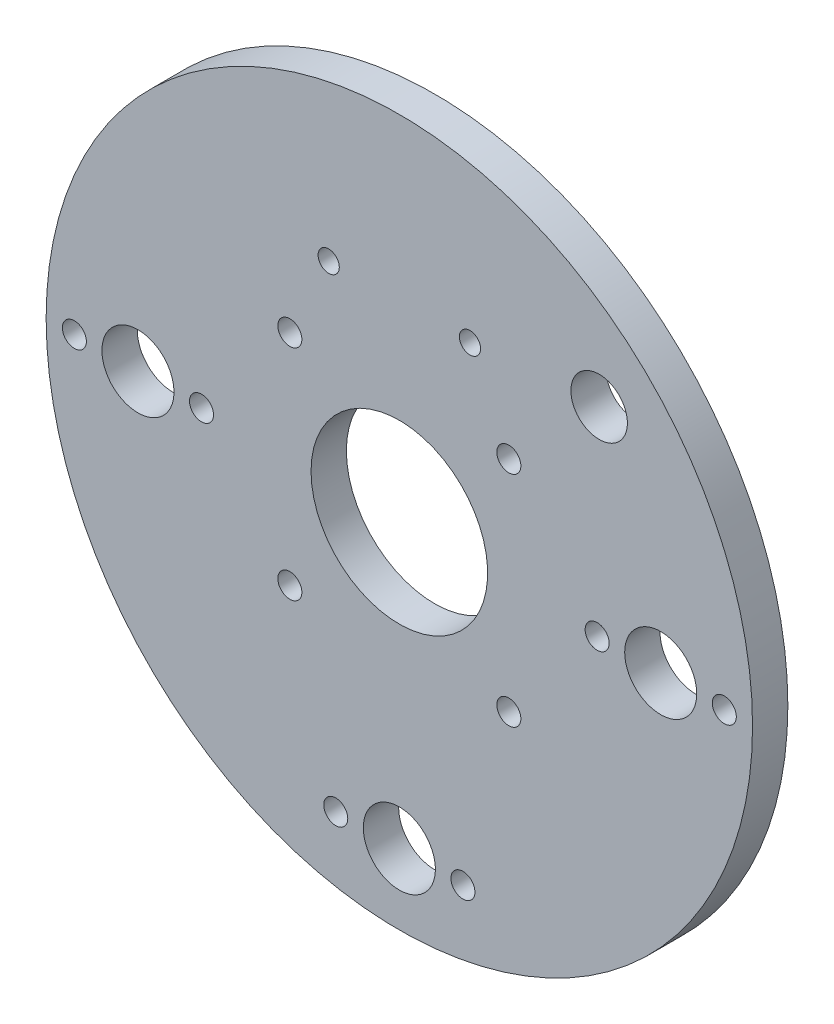
ISO-10303-21;
HEADER;
FILE_DESCRIPTION(('STEP AP214'),'2;1');
FILE_NAME('part.step','',(''),(''),'','','');
FILE_SCHEMA(('AUTOMOTIVE_DESIGN { 1 0 10303 214 1 1 1 1 }'));
ENDSEC;
DATA;
#1=APPLICATION_CONTEXT('core data for automotive mechanical design processes');
#2=APPLICATION_PROTOCOL_DEFINITION('international standard','automotive_design',2000,#1);
#3=PRODUCT_CONTEXT('',#1,'mechanical');
#4=PRODUCT('Part','Part','',(#3));
#5=PRODUCT_RELATED_PRODUCT_CATEGORY('part','',(#4));
#6=PRODUCT_DEFINITION_FORMATION('','',#4);
#7=PRODUCT_DEFINITION_CONTEXT('part definition',#1,'design');
#8=PRODUCT_DEFINITION('design','',#6,#7);
#9=PRODUCT_DEFINITION_SHAPE('','',#8);
#10=(LENGTH_UNIT() NAMED_UNIT(*) SI_UNIT(.MILLI.,.METRE.));
#11=(NAMED_UNIT(*) PLANE_ANGLE_UNIT() SI_UNIT($,.RADIAN.));
#12=(NAMED_UNIT(*) SI_UNIT($,.STERADIAN.) SOLID_ANGLE_UNIT());
#13=UNCERTAINTY_MEASURE_WITH_UNIT(LENGTH_MEASURE(1.E-05),#10,'distance_accuracy_value','');
#14=(GEOMETRIC_REPRESENTATION_CONTEXT(3) GLOBAL_UNCERTAINTY_ASSIGNED_CONTEXT((#13)) GLOBAL_UNIT_ASSIGNED_CONTEXT((#10,
#11,#12)) REPRESENTATION_CONTEXT('',''));
#15=CARTESIAN_POINT('',(0.,0.,0.));
#16=DIRECTION('',(0.,0.,1.));
#17=DIRECTION('',(1.,0.,0.));
#18=AXIS2_PLACEMENT_3D('',#15,#16,#17);
#19=CARTESIAN_POINT('',(0.,0.,5.));
#20=DIRECTION('',(0.,0.,-1.));
#21=DIRECTION('',(-1.,0.,0.));
#22=AXIS2_PLACEMENT_3D('',#19,#20,#21);
#23=CYLINDRICAL_SURFACE('',#22,50.);
#24=CARTESIAN_POINT('',(0.,0.,5.));
#25=DIRECTION('',(0.,0.,1.));
#26=DIRECTION('',(1.,0.,0.));
#27=AXIS2_PLACEMENT_3D('',#24,#25,#26);
#28=CIRCLE('',#27,50.);
#29=CARTESIAN_POINT('',(50.,0.,5.));
#30=VERTEX_POINT('',#29);
#31=EDGE_CURVE('E10',#30,#30,#28,.T.);
#32=ORIENTED_EDGE('',*,*,#31,.F.);
#33=EDGE_LOOP('',(#32));
#34=FACE_BOUND('',#33,.T.);
#35=CARTESIAN_POINT('',(0.,0.,0.));
#36=DIRECTION('',(0.,0.,1.));
#37=DIRECTION('',(1.,0.,0.));
#38=AXIS2_PLACEMENT_3D('',#35,#36,#37);
#39=CIRCLE('',#38,50.);
#40=CARTESIAN_POINT('',(50.,0.,0.));
#41=VERTEX_POINT('',#40);
#42=EDGE_CURVE('E39',#41,#41,#39,.T.);
#43=ORIENTED_EDGE('',*,*,#42,.T.);
#44=EDGE_LOOP('',(#43));
#45=FACE_BOUND('',#44,.T.);
#46=ADVANCED_FACE('F32',(#34,#45),#23,.T.);
#47=CARTESIAN_POINT('',(0.,0.,5.));
#48=DIRECTION('',(0.,0.,1.));
#49=DIRECTION('',(1.,0.,0.));
#50=AXIS2_PLACEMENT_3D('',#47,#48,#49);
#51=PLANE('',#50);
#52=CARTESIAN_POINT('',(28.2842712474618,28.284271247462,5.));
#53=DIRECTION('',(0.,0.,1.));
#54=DIRECTION('',(1.,0.,0.));
#55=AXIS2_PLACEMENT_3D('',#52,#53,#54);
#56=CIRCLE('',#55,4.);
#57=CARTESIAN_POINT('',(32.2842712474618,28.284271247462,5.));
#58=VERTEX_POINT('',#57);
#59=EDGE_CURVE('E176',#58,#58,#56,.T.);
#60=ORIENTED_EDGE('',*,*,#59,.F.);
#61=EDGE_LOOP('',(#60));
#62=FACE_BOUND('',#61,.T.);
#63=CARTESIAN_POINT('',(-10.,27.,5.));
#64=DIRECTION('',(0.,0.,1.));
#65=DIRECTION('',(1.,0.,0.));
#66=AXIS2_PLACEMENT_3D('',#63,#64,#65);
#67=CIRCLE('',#66,1.5);
#68=CARTESIAN_POINT('',(-8.5,27.,5.));
#69=VERTEX_POINT('',#68);
#70=EDGE_CURVE('E52',#69,#69,#67,.T.);
#71=ORIENTED_EDGE('',*,*,#70,.F.);
#72=EDGE_LOOP('',(#71));
#73=FACE_BOUND('',#72,.T.);
#74=CARTESIAN_POINT('',(10.,27.,5.));
#75=DIRECTION('',(0.,0.,1.));
#76=DIRECTION('',(1.,0.,0.));
#77=AXIS2_PLACEMENT_3D('',#74,#75,#76);
#78=CIRCLE('',#77,1.5);
#79=CARTESIAN_POINT('',(11.5,27.,5.));
#80=VERTEX_POINT('',#79);
#81=EDGE_CURVE('E66',#80,#80,#78,.T.);
#82=ORIENTED_EDGE('',*,*,#81,.F.);
#83=EDGE_LOOP('',(#82));
#84=FACE_BOUND('',#83,.T.);
#85=CARTESIAN_POINT('',(15.5,15.5,5.));
#86=DIRECTION('',(0.,0.,1.));
#87=DIRECTION('',(1.,0.,0.));
#88=AXIS2_PLACEMENT_3D('',#85,#86,#87);
#89=CIRCLE('',#88,1.7);
#90=CARTESIAN_POINT('',(17.2,15.5,5.));
#91=VERTEX_POINT('',#90);
#92=EDGE_CURVE('E54',#91,#91,#89,.T.);
#93=ORIENTED_EDGE('',*,*,#92,.F.);
#94=EDGE_LOOP('',(#93));
#95=FACE_BOUND('',#94,.T.);
#96=CARTESIAN_POINT('',(15.5000000000009,-15.5,5.));
#97=DIRECTION('',(0.,0.,1.));
#98=DIRECTION('',(1.,0.,0.));
#99=AXIS2_PLACEMENT_3D('',#96,#97,#98);
#100=CIRCLE('',#99,1.7);
#101=CARTESIAN_POINT('',(17.2000000000009,-15.5,5.));
#102=VERTEX_POINT('',#101);
#103=EDGE_CURVE('E63',#102,#102,#100,.T.);
#104=ORIENTED_EDGE('',*,*,#103,.F.);
#105=EDGE_LOOP('',(#104));
#106=FACE_BOUND('',#105,.T.);
#107=CARTESIAN_POINT('',(-15.4999999999991,-15.5000000000009,5.));
#108=DIRECTION('',(0.,0.,1.));
#109=DIRECTION('',(1.,0.,0.));
#110=AXIS2_PLACEMENT_3D('',#107,#108,#109);
#111=CIRCLE('',#110,1.7);
#112=CARTESIAN_POINT('',(-13.7999999999991,-15.5000000000009,5.));
#113=VERTEX_POINT('',#112);
#114=EDGE_CURVE('E74',#113,#113,#111,.T.);
#115=ORIENTED_EDGE('',*,*,#114,.F.);
#116=EDGE_LOOP('',(#115));
#117=FACE_BOUND('',#116,.T.);
#118=CARTESIAN_POINT('',(-15.5,15.4999999999991,5.));
#119=DIRECTION('',(0.,0.,1.));
#120=DIRECTION('',(1.,0.,0.));
#121=AXIS2_PLACEMENT_3D('',#118,#119,#120);
#122=CIRCLE('',#121,1.7);
#123=CARTESIAN_POINT('',(-13.8,15.4999999999991,5.));
#124=VERTEX_POINT('',#123);
#125=EDGE_CURVE('E80',#124,#124,#122,.T.);
#126=ORIENTED_EDGE('',*,*,#125,.F.);
#127=EDGE_LOOP('',(#126));
#128=FACE_BOUND('',#127,.T.);
#129=CARTESIAN_POINT('',(46.,0.,5.));
#130=DIRECTION('',(0.,0.,1.));
#131=DIRECTION('',(1.,0.,0.));
#132=AXIS2_PLACEMENT_3D('',#129,#130,#131);
#133=CIRCLE('',#132,1.7);
#134=CARTESIAN_POINT('',(47.7,0.,5.));
#135=VERTEX_POINT('',#134);
#136=EDGE_CURVE('E86',#135,#135,#133,.T.);
#137=ORIENTED_EDGE('',*,*,#136,.F.);
#138=EDGE_LOOP('',(#137));
#139=FACE_BOUND('',#138,.T.);
#140=CARTESIAN_POINT('',(28.,0.,5.));
#141=DIRECTION('',(0.,0.,1.));
#142=DIRECTION('',(1.,0.,0.));
#143=AXIS2_PLACEMENT_3D('',#140,#141,#142);
#144=CIRCLE('',#143,1.7);
#145=CARTESIAN_POINT('',(29.7,0.,5.));
#146=VERTEX_POINT('',#145);
#147=EDGE_CURVE('E92',#146,#146,#144,.T.);
#148=ORIENTED_EDGE('',*,*,#147,.F.);
#149=EDGE_LOOP('',(#148));
#150=FACE_BOUND('',#149,.T.);
#151=CARTESIAN_POINT('',(9.,-40.,5.));
#152=DIRECTION('',(0.,0.,1.));
#153=DIRECTION('',(1.,0.,0.));
#154=AXIS2_PLACEMENT_3D('',#151,#152,#153);
#155=CIRCLE('',#154,1.7);
#156=CARTESIAN_POINT('',(10.7,-40.,5.));
#157=VERTEX_POINT('',#156);
#158=EDGE_CURVE('E98',#157,#157,#155,.T.);
#159=ORIENTED_EDGE('',*,*,#158,.F.);
#160=EDGE_LOOP('',(#159));
#161=FACE_BOUND('',#160,.T.);
#162=CARTESIAN_POINT('',(-9.,-40.,5.));
#163=DIRECTION('',(0.,0.,1.));
#164=DIRECTION('',(1.,0.,0.));
#165=AXIS2_PLACEMENT_3D('',#162,#163,#164);
#166=CIRCLE('',#165,1.7);
#167=CARTESIAN_POINT('',(-7.3,-40.,5.));
#168=VERTEX_POINT('',#167);
#169=EDGE_CURVE('E104',#168,#168,#166,.T.);
#170=ORIENTED_EDGE('',*,*,#169,.F.);
#171=EDGE_LOOP('',(#170));
#172=FACE_BOUND('',#171,.T.);
#173=CARTESIAN_POINT('',(-46.,2.97129651685814E-13,5.));
#174=DIRECTION('',(0.,0.,1.));
#175=DIRECTION('',(1.,0.,0.));
#176=AXIS2_PLACEMENT_3D('',#173,#174,#175);
#177=CIRCLE('',#176,1.7);
#178=CARTESIAN_POINT('',(-44.3,2.97129651685814E-13,5.));
#179=VERTEX_POINT('',#178);
#180=EDGE_CURVE('E110',#179,#179,#177,.T.);
#181=ORIENTED_EDGE('',*,*,#180,.F.);
#182=EDGE_LOOP('',(#181));
#183=FACE_BOUND('',#182,.T.);
#184=CARTESIAN_POINT('',(-28.,-1.71810817162361E-12,5.));
#185=DIRECTION('',(0.,0.,1.));
#186=DIRECTION('',(1.,0.,0.));
#187=AXIS2_PLACEMENT_3D('',#184,#185,#186);
#188=CIRCLE('',#187,1.7);
#189=CARTESIAN_POINT('',(-26.3,-1.71810817162361E-12,5.));
#190=VERTEX_POINT('',#189);
#191=EDGE_CURVE('E116',#190,#190,#188,.T.);
#192=ORIENTED_EDGE('',*,*,#191,.F.);
#193=EDGE_LOOP('',(#192));
#194=FACE_BOUND('',#193,.T.);
#195=CARTESIAN_POINT('',(-37.,0.,5.));
#196=DIRECTION('',(0.,0.,-1.));
#197=DIRECTION('',(-1.,0.,0.));
#198=AXIS2_PLACEMENT_3D('',#195,#196,#197);
#199=CIRCLE('',#198,5.1);
#200=CARTESIAN_POINT('',(-42.1,0.,5.));
#201=VERTEX_POINT('',#200);
#202=EDGE_CURVE('E125',#201,#201,#199,.T.);
#203=ORIENTED_EDGE('',*,*,#202,.T.);
#204=EDGE_LOOP('',(#203));
#205=FACE_BOUND('',#204,.T.);
#206=CARTESIAN_POINT('',(37.,2.68166793467571E-13,5.));
#207=DIRECTION('',(0.,0.,-1.));
#208=DIRECTION('',(-1.,0.,0.));
#209=AXIS2_PLACEMENT_3D('',#206,#207,#208);
#210=CIRCLE('',#209,5.1);
#211=CARTESIAN_POINT('',(31.9,2.68166793467571E-13,5.));
#212=VERTEX_POINT('',#211);
#213=EDGE_CURVE('E131',#212,#212,#210,.T.);
#214=ORIENTED_EDGE('',*,*,#213,.T.);
#215=EDGE_LOOP('',(#214));
#216=FACE_BOUND('',#215,.T.);
#217=CARTESIAN_POINT('',(0.,-40.,5.));
#218=DIRECTION('',(0.,0.,-1.));
#219=DIRECTION('',(-1.,0.,0.));
#220=AXIS2_PLACEMENT_3D('',#217,#218,#219);
#221=CIRCLE('',#220,5.1);
#222=CARTESIAN_POINT('',(-5.1,-40.,5.));
#223=VERTEX_POINT('',#222);
#224=EDGE_CURVE('E137',#223,#223,#221,.T.);
#225=ORIENTED_EDGE('',*,*,#224,.T.);
#226=EDGE_LOOP('',(#225));
#227=FACE_BOUND('',#226,.T.);
#228=CARTESIAN_POINT('',(0.,0.,5.));
#229=DIRECTION('',(0.,0.,-1.));
#230=DIRECTION('',(-1.,0.,0.));
#231=AXIS2_PLACEMENT_3D('',#228,#229,#230);
#232=CIRCLE('',#231,12.5);
#233=CARTESIAN_POINT('',(-12.5,0.,5.));
#234=VERTEX_POINT('',#233);
#235=EDGE_CURVE('E44',#234,#234,#232,.T.);
#236=ORIENTED_EDGE('',*,*,#235,.T.);
#237=EDGE_LOOP('',(#236));
#238=FACE_BOUND('',#237,.T.);
#239=ORIENTED_EDGE('',*,*,#31,.T.);
#240=EDGE_LOOP('',(#239));
#241=FACE_BOUND('',#240,.T.);
#242=ADVANCED_FACE('F146',(#62,#73,#84,#95,#106,#117,#128,#139,#150,#161,#172,#183,#194,#205,
#216,#227,#238,#241),#51,.T.);
#243=CARTESIAN_POINT('',(0.,0.,0.));
#244=DIRECTION('',(0.,0.,1.));
#245=DIRECTION('',(1.,0.,0.));
#246=AXIS2_PLACEMENT_3D('',#243,#244,#245);
#247=PLANE('',#246);
#248=CARTESIAN_POINT('',(28.2842712474618,28.284271247462,0.));
#249=DIRECTION('',(0.,0.,1.));
#250=DIRECTION('',(1.,0.,0.));
#251=AXIS2_PLACEMENT_3D('',#248,#249,#250);
#252=CIRCLE('',#251,4.);
#253=CARTESIAN_POINT('',(32.2842712474618,28.284271247462,0.));
#254=VERTEX_POINT('',#253);
#255=EDGE_CURVE('E35',#254,#254,#252,.T.);
#256=ORIENTED_EDGE('',*,*,#255,.T.);
#257=EDGE_LOOP('',(#256));
#258=FACE_BOUND('',#257,.T.);
#259=CARTESIAN_POINT('',(-10.,27.,0.));
#260=DIRECTION('',(0.,0.,1.));
#261=DIRECTION('',(1.,0.,0.));
#262=AXIS2_PLACEMENT_3D('',#259,#260,#261);
#263=CIRCLE('',#262,1.5);
#264=CARTESIAN_POINT('',(-8.5,27.,0.));
#265=VERTEX_POINT('',#264);
#266=EDGE_CURVE('E51',#265,#265,#263,.T.);
#267=ORIENTED_EDGE('',*,*,#266,.T.);
#268=EDGE_LOOP('',(#267));
#269=FACE_BOUND('',#268,.T.);
#270=CARTESIAN_POINT('',(10.,27.,0.));
#271=DIRECTION('',(0.,0.,1.));
#272=DIRECTION('',(1.,0.,0.));
#273=AXIS2_PLACEMENT_3D('',#270,#271,#272);
#274=CIRCLE('',#273,1.5);
#275=CARTESIAN_POINT('',(11.5,27.,0.));
#276=VERTEX_POINT('',#275);
#277=EDGE_CURVE('E49',#276,#276,#274,.T.);
#278=ORIENTED_EDGE('',*,*,#277,.T.);
#279=EDGE_LOOP('',(#278));
#280=FACE_BOUND('',#279,.T.);
#281=CARTESIAN_POINT('',(15.5,15.5,0.));
#282=DIRECTION('',(0.,0.,1.));
#283=DIRECTION('',(1.,0.,0.));
#284=AXIS2_PLACEMENT_3D('',#281,#282,#283);
#285=CIRCLE('',#284,1.7);
#286=CARTESIAN_POINT('',(17.2,15.5,0.));
#287=VERTEX_POINT('',#286);
#288=EDGE_CURVE('E58',#287,#287,#285,.T.);
#289=ORIENTED_EDGE('',*,*,#288,.T.);
#290=EDGE_LOOP('',(#289));
#291=FACE_BOUND('',#290,.T.);
#292=CARTESIAN_POINT('',(15.5000000000009,-15.5,0.));
#293=DIRECTION('',(0.,0.,1.));
#294=DIRECTION('',(1.,0.,0.));
#295=AXIS2_PLACEMENT_3D('',#292,#293,#294);
#296=CIRCLE('',#295,1.7);
#297=CARTESIAN_POINT('',(17.2000000000009,-15.5,0.));
#298=VERTEX_POINT('',#297);
#299=EDGE_CURVE('E71',#298,#298,#296,.T.);
#300=ORIENTED_EDGE('',*,*,#299,.T.);
#301=EDGE_LOOP('',(#300));
#302=FACE_BOUND('',#301,.T.);
#303=CARTESIAN_POINT('',(-15.4999999999991,-15.5000000000009,0.));
#304=DIRECTION('',(0.,0.,1.));
#305=DIRECTION('',(1.,0.,0.));
#306=AXIS2_PLACEMENT_3D('',#303,#304,#305);
#307=CIRCLE('',#306,1.7);
#308=CARTESIAN_POINT('',(-13.7999999999991,-15.5000000000009,0.));
#309=VERTEX_POINT('',#308);
#310=EDGE_CURVE('E77',#309,#309,#307,.T.);
#311=ORIENTED_EDGE('',*,*,#310,.T.);
#312=EDGE_LOOP('',(#311));
#313=FACE_BOUND('',#312,.T.);
#314=CARTESIAN_POINT('',(-15.5,15.4999999999991,0.));
#315=DIRECTION('',(0.,0.,1.));
#316=DIRECTION('',(1.,0.,0.));
#317=AXIS2_PLACEMENT_3D('',#314,#315,#316);
#318=CIRCLE('',#317,1.7);
#319=CARTESIAN_POINT('',(-13.8,15.4999999999991,0.));
#320=VERTEX_POINT('',#319);
#321=EDGE_CURVE('E83',#320,#320,#318,.T.);
#322=ORIENTED_EDGE('',*,*,#321,.T.);
#323=EDGE_LOOP('',(#322));
#324=FACE_BOUND('',#323,.T.);
#325=CARTESIAN_POINT('',(46.,0.,0.));
#326=DIRECTION('',(0.,0.,1.));
#327=DIRECTION('',(1.,0.,0.));
#328=AXIS2_PLACEMENT_3D('',#325,#326,#327);
#329=CIRCLE('',#328,1.7);
#330=CARTESIAN_POINT('',(47.7,0.,0.));
#331=VERTEX_POINT('',#330);
#332=EDGE_CURVE('E89',#331,#331,#329,.T.);
#333=ORIENTED_EDGE('',*,*,#332,.T.);
#334=EDGE_LOOP('',(#333));
#335=FACE_BOUND('',#334,.T.);
#336=CARTESIAN_POINT('',(28.,0.,0.));
#337=DIRECTION('',(0.,0.,1.));
#338=DIRECTION('',(1.,0.,0.));
#339=AXIS2_PLACEMENT_3D('',#336,#337,#338);
#340=CIRCLE('',#339,1.7);
#341=CARTESIAN_POINT('',(29.7,0.,0.));
#342=VERTEX_POINT('',#341);
#343=EDGE_CURVE('E95',#342,#342,#340,.T.);
#344=ORIENTED_EDGE('',*,*,#343,.T.);
#345=EDGE_LOOP('',(#344));
#346=FACE_BOUND('',#345,.T.);
#347=CARTESIAN_POINT('',(9.,-40.,0.));
#348=DIRECTION('',(0.,0.,1.));
#349=DIRECTION('',(1.,0.,0.));
#350=AXIS2_PLACEMENT_3D('',#347,#348,#349);
#351=CIRCLE('',#350,1.7);
#352=CARTESIAN_POINT('',(10.7,-40.,0.));
#353=VERTEX_POINT('',#352);
#354=EDGE_CURVE('E101',#353,#353,#351,.T.);
#355=ORIENTED_EDGE('',*,*,#354,.T.);
#356=EDGE_LOOP('',(#355));
#357=FACE_BOUND('',#356,.T.);
#358=CARTESIAN_POINT('',(-9.,-40.,0.));
#359=DIRECTION('',(0.,0.,1.));
#360=DIRECTION('',(1.,0.,0.));
#361=AXIS2_PLACEMENT_3D('',#358,#359,#360);
#362=CIRCLE('',#361,1.7);
#363=CARTESIAN_POINT('',(-7.3,-40.,0.));
#364=VERTEX_POINT('',#363);
#365=EDGE_CURVE('E107',#364,#364,#362,.T.);
#366=ORIENTED_EDGE('',*,*,#365,.T.);
#367=EDGE_LOOP('',(#366));
#368=FACE_BOUND('',#367,.T.);
#369=CARTESIAN_POINT('',(-46.,2.97129651685814E-13,0.));
#370=DIRECTION('',(0.,0.,1.));
#371=DIRECTION('',(1.,0.,0.));
#372=AXIS2_PLACEMENT_3D('',#369,#370,#371);
#373=CIRCLE('',#372,1.7);
#374=CARTESIAN_POINT('',(-44.3,2.97129651685814E-13,0.));
#375=VERTEX_POINT('',#374);
#376=EDGE_CURVE('E113',#375,#375,#373,.T.);
#377=ORIENTED_EDGE('',*,*,#376,.T.);
#378=EDGE_LOOP('',(#377));
#379=FACE_BOUND('',#378,.T.);
#380=CARTESIAN_POINT('',(-28.,-1.71810817162361E-12,0.));
#381=DIRECTION('',(0.,0.,1.));
#382=DIRECTION('',(1.,0.,0.));
#383=AXIS2_PLACEMENT_3D('',#380,#381,#382);
#384=CIRCLE('',#383,1.7);
#385=CARTESIAN_POINT('',(-26.3,-1.71810817162361E-12,0.));
#386=VERTEX_POINT('',#385);
#387=EDGE_CURVE('E119',#386,#386,#384,.T.);
#388=ORIENTED_EDGE('',*,*,#387,.T.);
#389=EDGE_LOOP('',(#388));
#390=FACE_BOUND('',#389,.T.);
#391=CARTESIAN_POINT('',(-37.,0.,0.));
#392=DIRECTION('',(0.,0.,-1.));
#393=DIRECTION('',(-1.,0.,0.));
#394=AXIS2_PLACEMENT_3D('',#391,#392,#393);
#395=CIRCLE('',#394,5.1);
#396=CARTESIAN_POINT('',(-42.1,0.,0.));
#397=VERTEX_POINT('',#396);
#398=EDGE_CURVE('E122',#397,#397,#395,.T.);
#399=ORIENTED_EDGE('',*,*,#398,.F.);
#400=EDGE_LOOP('',(#399));
#401=FACE_BOUND('',#400,.T.);
#402=CARTESIAN_POINT('',(37.,2.68166793467571E-13,0.));
#403=DIRECTION('',(0.,0.,-1.));
#404=DIRECTION('',(-1.,0.,0.));
#405=AXIS2_PLACEMENT_3D('',#402,#403,#404);
#406=CIRCLE('',#405,5.1);
#407=CARTESIAN_POINT('',(31.9,2.68166793467571E-13,0.));
#408=VERTEX_POINT('',#407);
#409=EDGE_CURVE('E128',#408,#408,#406,.T.);
#410=ORIENTED_EDGE('',*,*,#409,.F.);
#411=EDGE_LOOP('',(#410));
#412=FACE_BOUND('',#411,.T.);
#413=CARTESIAN_POINT('',(0.,-40.,0.));
#414=DIRECTION('',(0.,0.,-1.));
#415=DIRECTION('',(-1.,0.,0.));
#416=AXIS2_PLACEMENT_3D('',#413,#414,#415);
#417=CIRCLE('',#416,5.1);
#418=CARTESIAN_POINT('',(-5.1,-40.,0.));
#419=VERTEX_POINT('',#418);
#420=EDGE_CURVE('E134',#419,#419,#417,.T.);
#421=ORIENTED_EDGE('',*,*,#420,.F.);
#422=EDGE_LOOP('',(#421));
#423=FACE_BOUND('',#422,.T.);
#424=CARTESIAN_POINT('',(0.,0.,0.));
#425=DIRECTION('',(0.,0.,-1.));
#426=DIRECTION('',(-1.,0.,0.));
#427=AXIS2_PLACEMENT_3D('',#424,#425,#426);
#428=CIRCLE('',#427,12.5);
#429=CARTESIAN_POINT('',(-12.5,0.,0.));
#430=VERTEX_POINT('',#429);
#431=EDGE_CURVE('E139',#430,#430,#428,.T.);
#432=ORIENTED_EDGE('',*,*,#431,.F.);
#433=EDGE_LOOP('',(#432));
#434=FACE_BOUND('',#433,.T.);
#435=ORIENTED_EDGE('',*,*,#42,.F.);
#436=EDGE_LOOP('',(#435));
#437=FACE_BOUND('',#436,.T.);
#438=ADVANCED_FACE('F151',(#258,#269,#280,#291,#302,#313,#324,#335,#346,#357,#368,#379,#390,
#401,#412,#423,#434,#437),#247,.F.);
#439=CARTESIAN_POINT('',(0.,0.,0.));
#440=DIRECTION('',(0.,0.,-1.));
#441=DIRECTION('',(-1.,0.,0.));
#442=AXIS2_PLACEMENT_3D('',#439,#440,#441);
#443=CYLINDRICAL_SURFACE('',#442,12.5);
#444=ORIENTED_EDGE('',*,*,#235,.F.);
#445=EDGE_LOOP('',(#444));
#446=FACE_BOUND('',#445,.T.);
#447=ORIENTED_EDGE('',*,*,#431,.T.);
#448=EDGE_LOOP('',(#447));
#449=FACE_BOUND('',#448,.T.);
#450=ADVANCED_FACE('F148',(#446,#449),#443,.F.);
#451=CARTESIAN_POINT('',(0.,-40.,0.));
#452=DIRECTION('',(0.,0.,-1.));
#453=DIRECTION('',(-1.,0.,0.));
#454=AXIS2_PLACEMENT_3D('',#451,#452,#453);
#455=CYLINDRICAL_SURFACE('',#454,5.1);
#456=ORIENTED_EDGE('',*,*,#224,.F.);
#457=EDGE_LOOP('',(#456));
#458=FACE_BOUND('',#457,.T.);
#459=ORIENTED_EDGE('',*,*,#420,.T.);
#460=EDGE_LOOP('',(#459));
#461=FACE_BOUND('',#460,.T.);
#462=ADVANCED_FACE('F150',(#458,#461),#455,.F.);
#463=CARTESIAN_POINT('',(37.,2.68166793467571E-13,0.));
#464=DIRECTION('',(0.,0.,-1.));
#465=DIRECTION('',(-1.,0.,0.));
#466=AXIS2_PLACEMENT_3D('',#463,#464,#465);
#467=CYLINDRICAL_SURFACE('',#466,5.1);
#468=ORIENTED_EDGE('',*,*,#213,.F.);
#469=EDGE_LOOP('',(#468));
#470=FACE_BOUND('',#469,.T.);
#471=ORIENTED_EDGE('',*,*,#409,.T.);
#472=EDGE_LOOP('',(#471));
#473=FACE_BOUND('',#472,.T.);
#474=ADVANCED_FACE('F157',(#470,#473),#467,.F.);
#475=CARTESIAN_POINT('',(-37.,0.,0.));
#476=DIRECTION('',(0.,0.,-1.));
#477=DIRECTION('',(-1.,0.,0.));
#478=AXIS2_PLACEMENT_3D('',#475,#476,#477);
#479=CYLINDRICAL_SURFACE('',#478,5.1);
#480=ORIENTED_EDGE('',*,*,#202,.F.);
#481=EDGE_LOOP('',(#480));
#482=FACE_BOUND('',#481,.T.);
#483=ORIENTED_EDGE('',*,*,#398,.T.);
#484=EDGE_LOOP('',(#483));
#485=FACE_BOUND('',#484,.T.);
#486=ADVANCED_FACE('F214',(#482,#485),#479,.F.);
#487=CARTESIAN_POINT('',(-28.,-1.71810817162361E-12,5.));
#488=DIRECTION('',(0.,0.,1.));
#489=DIRECTION('',(1.,0.,0.));
#490=AXIS2_PLACEMENT_3D('',#487,#488,#489);
#491=CYLINDRICAL_SURFACE('',#490,1.7);
#492=ORIENTED_EDGE('',*,*,#387,.F.);
#493=EDGE_LOOP('',(#492));
#494=FACE_BOUND('',#493,.T.);
#495=ORIENTED_EDGE('',*,*,#191,.T.);
#496=EDGE_LOOP('',(#495));
#497=FACE_BOUND('',#496,.T.);
#498=ADVANCED_FACE('F221',(#494,#497),#491,.F.);
#499=CARTESIAN_POINT('',(-46.,2.97129651685814E-13,5.));
#500=DIRECTION('',(0.,0.,1.));
#501=DIRECTION('',(1.,0.,0.));
#502=AXIS2_PLACEMENT_3D('',#499,#500,#501);
#503=CYLINDRICAL_SURFACE('',#502,1.7);
#504=ORIENTED_EDGE('',*,*,#376,.F.);
#505=EDGE_LOOP('',(#504));
#506=FACE_BOUND('',#505,.T.);
#507=ORIENTED_EDGE('',*,*,#180,.T.);
#508=EDGE_LOOP('',(#507));
#509=FACE_BOUND('',#508,.T.);
#510=ADVANCED_FACE('F227',(#506,#509),#503,.F.);
#511=CARTESIAN_POINT('',(-9.,-40.,5.));
#512=DIRECTION('',(0.,0.,1.));
#513=DIRECTION('',(1.,0.,0.));
#514=AXIS2_PLACEMENT_3D('',#511,#512,#513);
#515=CYLINDRICAL_SURFACE('',#514,1.7);
#516=ORIENTED_EDGE('',*,*,#365,.F.);
#517=EDGE_LOOP('',(#516));
#518=FACE_BOUND('',#517,.T.);
#519=ORIENTED_EDGE('',*,*,#169,.T.);
#520=EDGE_LOOP('',(#519));
#521=FACE_BOUND('',#520,.T.);
#522=ADVANCED_FACE('F231',(#518,#521),#515,.F.);
#523=CARTESIAN_POINT('',(9.,-40.,5.));
#524=DIRECTION('',(0.,0.,1.));
#525=DIRECTION('',(1.,0.,0.));
#526=AXIS2_PLACEMENT_3D('',#523,#524,#525);
#527=CYLINDRICAL_SURFACE('',#526,1.7);
#528=ORIENTED_EDGE('',*,*,#354,.F.);
#529=EDGE_LOOP('',(#528));
#530=FACE_BOUND('',#529,.T.);
#531=ORIENTED_EDGE('',*,*,#158,.T.);
#532=EDGE_LOOP('',(#531));
#533=FACE_BOUND('',#532,.T.);
#534=ADVANCED_FACE('F235',(#530,#533),#527,.F.);
#535=CARTESIAN_POINT('',(28.,0.,5.));
#536=DIRECTION('',(0.,0.,1.));
#537=DIRECTION('',(1.,0.,0.));
#538=AXIS2_PLACEMENT_3D('',#535,#536,#537);
#539=CYLINDRICAL_SURFACE('',#538,1.7);
#540=ORIENTED_EDGE('',*,*,#343,.F.);
#541=EDGE_LOOP('',(#540));
#542=FACE_BOUND('',#541,.T.);
#543=ORIENTED_EDGE('',*,*,#147,.T.);
#544=EDGE_LOOP('',(#543));
#545=FACE_BOUND('',#544,.T.);
#546=ADVANCED_FACE('F239',(#542,#545),#539,.F.);
#547=CARTESIAN_POINT('',(46.,0.,5.));
#548=DIRECTION('',(0.,0.,1.));
#549=DIRECTION('',(1.,0.,0.));
#550=AXIS2_PLACEMENT_3D('',#547,#548,#549);
#551=CYLINDRICAL_SURFACE('',#550,1.7);
#552=ORIENTED_EDGE('',*,*,#332,.F.);
#553=EDGE_LOOP('',(#552));
#554=FACE_BOUND('',#553,.T.);
#555=ORIENTED_EDGE('',*,*,#136,.T.);
#556=EDGE_LOOP('',(#555));
#557=FACE_BOUND('',#556,.T.);
#558=ADVANCED_FACE('F243',(#554,#557),#551,.F.);
#559=CARTESIAN_POINT('',(-15.5,15.4999999999991,5.));
#560=DIRECTION('',(0.,0.,1.));
#561=DIRECTION('',(1.,0.,0.));
#562=AXIS2_PLACEMENT_3D('',#559,#560,#561);
#563=CYLINDRICAL_SURFACE('',#562,1.7);
#564=ORIENTED_EDGE('',*,*,#321,.F.);
#565=EDGE_LOOP('',(#564));
#566=FACE_BOUND('',#565,.T.);
#567=ORIENTED_EDGE('',*,*,#125,.T.);
#568=EDGE_LOOP('',(#567));
#569=FACE_BOUND('',#568,.T.);
#570=ADVANCED_FACE('F247',(#566,#569),#563,.F.);
#571=CARTESIAN_POINT('',(-15.4999999999991,-15.5000000000009,5.));
#572=DIRECTION('',(0.,0.,1.));
#573=DIRECTION('',(1.,0.,0.));
#574=AXIS2_PLACEMENT_3D('',#571,#572,#573);
#575=CYLINDRICAL_SURFACE('',#574,1.7);
#576=ORIENTED_EDGE('',*,*,#310,.F.);
#577=EDGE_LOOP('',(#576));
#578=FACE_BOUND('',#577,.T.);
#579=ORIENTED_EDGE('',*,*,#114,.T.);
#580=EDGE_LOOP('',(#579));
#581=FACE_BOUND('',#580,.T.);
#582=ADVANCED_FACE('F251',(#578,#581),#575,.F.);
#583=CARTESIAN_POINT('',(15.5000000000009,-15.5,5.));
#584=DIRECTION('',(0.,0.,1.));
#585=DIRECTION('',(1.,0.,0.));
#586=AXIS2_PLACEMENT_3D('',#583,#584,#585);
#587=CYLINDRICAL_SURFACE('',#586,1.7);
#588=ORIENTED_EDGE('',*,*,#299,.F.);
#589=EDGE_LOOP('',(#588));
#590=FACE_BOUND('',#589,.T.);
#591=ORIENTED_EDGE('',*,*,#103,.T.);
#592=EDGE_LOOP('',(#591));
#593=FACE_BOUND('',#592,.T.);
#594=ADVANCED_FACE('F255',(#590,#593),#587,.F.);
#595=CARTESIAN_POINT('',(15.5,15.5,5.));
#596=DIRECTION('',(0.,0.,1.));
#597=DIRECTION('',(1.,0.,0.));
#598=AXIS2_PLACEMENT_3D('',#595,#596,#597);
#599=CYLINDRICAL_SURFACE('',#598,1.7);
#600=ORIENTED_EDGE('',*,*,#288,.F.);
#601=EDGE_LOOP('',(#600));
#602=FACE_BOUND('',#601,.T.);
#603=ORIENTED_EDGE('',*,*,#92,.T.);
#604=EDGE_LOOP('',(#603));
#605=FACE_BOUND('',#604,.T.);
#606=ADVANCED_FACE('F259',(#602,#605),#599,.F.);
#607=CARTESIAN_POINT('',(10.,27.,-5.));
#608=DIRECTION('',(0.,0.,1.));
#609=DIRECTION('',(1.,0.,0.));
#610=AXIS2_PLACEMENT_3D('',#607,#608,#609);
#611=CYLINDRICAL_SURFACE('',#610,1.5);
#612=ORIENTED_EDGE('',*,*,#81,.T.);
#613=EDGE_LOOP('',(#612));
#614=FACE_BOUND('',#613,.T.);
#615=ORIENTED_EDGE('',*,*,#277,.F.);
#616=EDGE_LOOP('',(#615));
#617=FACE_BOUND('',#616,.T.);
#618=ADVANCED_FACE('F263',(#614,#617),#611,.F.);
#619=CARTESIAN_POINT('',(-10.,27.,-5.));
#620=DIRECTION('',(0.,0.,1.));
#621=DIRECTION('',(1.,0.,0.));
#622=AXIS2_PLACEMENT_3D('',#619,#620,#621);
#623=CYLINDRICAL_SURFACE('',#622,1.5);
#624=ORIENTED_EDGE('',*,*,#70,.T.);
#625=EDGE_LOOP('',(#624));
#626=FACE_BOUND('',#625,.T.);
#627=ORIENTED_EDGE('',*,*,#266,.F.);
#628=EDGE_LOOP('',(#627));
#629=FACE_BOUND('',#628,.T.);
#630=ADVANCED_FACE('F267',(#626,#629),#623,.F.);
#631=CARTESIAN_POINT('',(28.2842712474618,28.284271247462,-5.));
#632=DIRECTION('',(0.,0.,1.));
#633=DIRECTION('',(1.,0.,0.));
#634=AXIS2_PLACEMENT_3D('',#631,#632,#633);
#635=CYLINDRICAL_SURFACE('',#634,4.);
#636=ORIENTED_EDGE('',*,*,#59,.T.);
#637=EDGE_LOOP('',(#636));
#638=FACE_BOUND('',#637,.T.);
#639=ORIENTED_EDGE('',*,*,#255,.F.);
#640=EDGE_LOOP('',(#639));
#641=FACE_BOUND('',#640,.T.);
#642=ADVANCED_FACE('F271',(#638,#641),#635,.F.);
#643=CLOSED_SHELL('',(#46,#242,#438,#450,#462,#474,#486,#498,#510,#522,#534,#546,#558,#570,#582,
#594,#606,#618,#630,#642));
#644=MANIFOLD_SOLID_BREP('B2',#643);
#645=ADVANCED_BREP_SHAPE_REPRESENTATION('',(#18,#644),#14);
#646=SHAPE_DEFINITION_REPRESENTATION(#9,#645);
ENDSEC;
END-ISO-10303-21;
